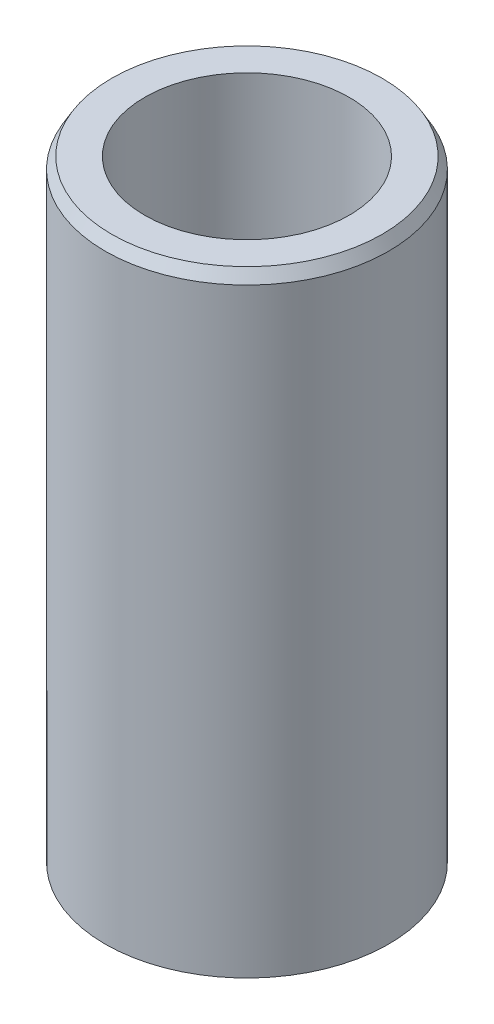
ISO-10303-21;
HEADER;
FILE_DESCRIPTION(('STEP AP214'),'2;1');
FILE_NAME('part.step','',(''),(''),'','','');
FILE_SCHEMA(('AUTOMOTIVE_DESIGN { 1 0 10303 214 1 1 1 1 }'));
ENDSEC;
DATA;
#1=APPLICATION_CONTEXT('core data for automotive mechanical design processes');
#2=APPLICATION_PROTOCOL_DEFINITION('international standard','automotive_design',2000,#1);
#3=PRODUCT_CONTEXT('',#1,'mechanical');
#4=PRODUCT('Part','Part','',(#3));
#5=PRODUCT_RELATED_PRODUCT_CATEGORY('part','',(#4));
#6=PRODUCT_DEFINITION_FORMATION('','',#4);
#7=PRODUCT_DEFINITION_CONTEXT('part definition',#1,'design');
#8=PRODUCT_DEFINITION('design','',#6,#7);
#9=PRODUCT_DEFINITION_SHAPE('','',#8);
#10=(LENGTH_UNIT() NAMED_UNIT(*) SI_UNIT(.MILLI.,.METRE.));
#11=(NAMED_UNIT(*) PLANE_ANGLE_UNIT() SI_UNIT($,.RADIAN.));
#12=(NAMED_UNIT(*) SI_UNIT($,.STERADIAN.) SOLID_ANGLE_UNIT());
#13=UNCERTAINTY_MEASURE_WITH_UNIT(LENGTH_MEASURE(1.E-05),#10,'distance_accuracy_value','');
#14=(GEOMETRIC_REPRESENTATION_CONTEXT(3) GLOBAL_UNCERTAINTY_ASSIGNED_CONTEXT((#13)) GLOBAL_UNIT_ASSIGNED_CONTEXT((#10,
#11,#12)) REPRESENTATION_CONTEXT('',''));
#15=CARTESIAN_POINT('',(0.,0.,0.));
#16=DIRECTION('',(0.,0.,1.));
#17=DIRECTION('',(1.,0.,0.));
#18=AXIS2_PLACEMENT_3D('',#15,#16,#17);
#19=CARTESIAN_POINT('',(0.,250.681840265952,0.));
#20=DIRECTION('',(0.,-1.,0.));
#21=DIRECTION('',(0.,0.,-1.));
#22=AXIS2_PLACEMENT_3D('',#19,#20,#21);
#23=CYLINDRICAL_SURFACE('',#22,57.5);
#24=CARTESIAN_POINT('',(0.,246.082576106076,0.));
#25=DIRECTION('',(0.,1.,0.));
#26=DIRECTION('',(0.,0.,1.));
#27=AXIS2_PLACEMENT_3D('',#24,#25,#26);
#28=CIRCLE('',#27,57.5);
#29=CARTESIAN_POINT('',(0.,246.082576106076,57.5));
#30=VERTEX_POINT('',#29);
#31=EDGE_CURVE('E50',#30,#30,#28,.F.);
#32=ORIENTED_EDGE('',*,*,#31,.T.);
#33=EDGE_LOOP('',(#32));
#34=FACE_BOUND('',#33,.T.);
#35=CARTESIAN_POINT('',(0.,2.65538640077881,0.));
#36=DIRECTION('',(0.,1.,0.));
#37=DIRECTION('',(0.,0.,1.));
#38=AXIS2_PLACEMENT_3D('',#35,#36,#37);
#39=CIRCLE('',#38,57.5);
#40=CARTESIAN_POINT('',(0.,2.65538640077881,57.5));
#41=VERTEX_POINT('',#40);
#42=EDGE_CURVE('E51',#41,#41,#39,.T.);
#43=ORIENTED_EDGE('',*,*,#42,.T.);
#44=EDGE_LOOP('',(#43));
#45=FACE_BOUND('',#44,.T.);
#46=ADVANCED_FACE('F39',(#34,#45),#23,.T.);
#47=CARTESIAN_POINT('',(0.,250.681840265952,0.));
#48=DIRECTION('',(0.,1.,0.));
#49=DIRECTION('',(0.,0.,1.));
#50=AXIS2_PLACEMENT_3D('',#47,#48,#49);
#51=PLANE('',#50);
#52=CARTESIAN_POINT('',(0.,250.681840265952,0.));
#53=DIRECTION('',(0.,1.,0.));
#54=DIRECTION('',(0.,0.,1.));
#55=AXIS2_PLACEMENT_3D('',#52,#53,#54);
#56=CIRCLE('',#55,54.8446135992212);
#57=CARTESIAN_POINT('',(0.,250.681840265952,54.8446135992212));
#58=VERTEX_POINT('',#57);
#59=EDGE_CURVE('E54',#58,#58,#56,.T.);
#60=ORIENTED_EDGE('',*,*,#59,.T.);
#61=EDGE_LOOP('',(#60));
#62=FACE_BOUND('',#61,.T.);
#63=CARTESIAN_POINT('',(0.,250.681840265952,0.));
#64=DIRECTION('',(0.,1.,0.));
#65=DIRECTION('',(0.,0.,1.));
#66=AXIS2_PLACEMENT_3D('',#63,#64,#65);
#67=CIRCLE('',#66,41.4769723482848);
#68=CARTESIAN_POINT('',(0.,250.681840265952,41.4769723482848));
#69=VERTEX_POINT('',#68);
#70=EDGE_CURVE('E58',#69,#69,#67,.T.);
#71=ORIENTED_EDGE('',*,*,#70,.F.);
#72=EDGE_LOOP('',(#71));
#73=FACE_BOUND('',#72,.T.);
#74=ADVANCED_FACE('F69',(#62,#73),#51,.T.);
#75=CARTESIAN_POINT('',(0.,0.,0.));
#76=DIRECTION('',(0.,1.,0.));
#77=DIRECTION('',(0.,0.,1.));
#78=AXIS2_PLACEMENT_3D('',#75,#76,#77);
#79=PLANE('',#78);
#80=CARTESIAN_POINT('',(0.,0.,0.));
#81=DIRECTION('',(0.,1.,0.));
#82=DIRECTION('',(0.,0.,1.));
#83=AXIS2_PLACEMENT_3D('',#80,#81,#82);
#84=CIRCLE('',#83,52.9007358401236);
#85=CARTESIAN_POINT('',(0.,0.,52.9007358401236));
#86=VERTEX_POINT('',#85);
#87=EDGE_CURVE('E10',#86,#86,#84,.F.);
#88=ORIENTED_EDGE('',*,*,#87,.T.);
#89=EDGE_LOOP('',(#88));
#90=FACE_BOUND('',#89,.T.);
#91=CARTESIAN_POINT('',(0.,0.,0.));
#92=DIRECTION('',(0.,1.,0.));
#93=DIRECTION('',(0.,0.,1.));
#94=AXIS2_PLACEMENT_3D('',#91,#92,#93);
#95=CIRCLE('',#94,41.4769723482848);
#96=CARTESIAN_POINT('',(0.,0.,41.4769723482848));
#97=VERTEX_POINT('',#96);
#98=EDGE_CURVE('E63',#97,#97,#95,.T.);
#99=ORIENTED_EDGE('',*,*,#98,.T.);
#100=EDGE_LOOP('',(#99));
#101=FACE_BOUND('',#100,.T.);
#102=ADVANCED_FACE('F75',(#90,#101),#79,.F.);
#103=CARTESIAN_POINT('',(0.,250.681840265952,0.));
#104=DIRECTION('',(0.,-1.,0.));
#105=DIRECTION('',(0.,0.,-1.));
#106=AXIS2_PLACEMENT_3D('',#103,#104,#105);
#107=CYLINDRICAL_SURFACE('',#106,41.4769723482848);
#108=ORIENTED_EDGE('',*,*,#70,.T.);
#109=EDGE_LOOP('',(#108));
#110=FACE_BOUND('',#109,.T.);
#111=ORIENTED_EDGE('',*,*,#98,.F.);
#112=EDGE_LOOP('',(#111));
#113=FACE_BOUND('',#112,.T.);
#114=ADVANCED_FACE('F70',(#110,#113),#107,.F.);
#115=CARTESIAN_POINT('',(0.,250.681840265952,0.));
#116=DIRECTION('',(0.,-1.,0.));
#117=DIRECTION('',(0.,0.,-1.));
#118=AXIS2_PLACEMENT_3D('',#115,#116,#117);
#119=CONICAL_SURFACE('',#118,54.8446135992212,0.523598775598296);
#120=ORIENTED_EDGE('',*,*,#31,.F.);
#121=EDGE_LOOP('',(#120));
#122=FACE_BOUND('',#121,.T.);
#123=ORIENTED_EDGE('',*,*,#59,.F.);
#124=EDGE_LOOP('',(#123));
#125=FACE_BOUND('',#124,.T.);
#126=ADVANCED_FACE('F81',(#122,#125),#119,.T.);
#127=CARTESIAN_POINT('',(0.,2.65538640077881,0.));
#128=DIRECTION('',(0.,1.,0.));
#129=DIRECTION('',(0.,0.,1.));
#130=AXIS2_PLACEMENT_3D('',#127,#128,#129);
#131=CONICAL_SURFACE('',#130,57.5,1.0471975511966);
#132=ORIENTED_EDGE('',*,*,#87,.F.);
#133=EDGE_LOOP('',(#132));
#134=FACE_BOUND('',#133,.T.);
#135=ORIENTED_EDGE('',*,*,#42,.F.);
#136=EDGE_LOOP('',(#135));
#137=FACE_BOUND('',#136,.T.);
#138=ADVANCED_FACE('F45',(#134,#137),#131,.T.);
#139=CLOSED_SHELL('',(#46,#74,#102,#114,#126,#138));
#140=MANIFOLD_SOLID_BREP('B2',#139);
#141=ADVANCED_BREP_SHAPE_REPRESENTATION('',(#18,#140),#14);
#142=SHAPE_DEFINITION_REPRESENTATION(#9,#141);
ENDSEC;
END-ISO-10303-21;
